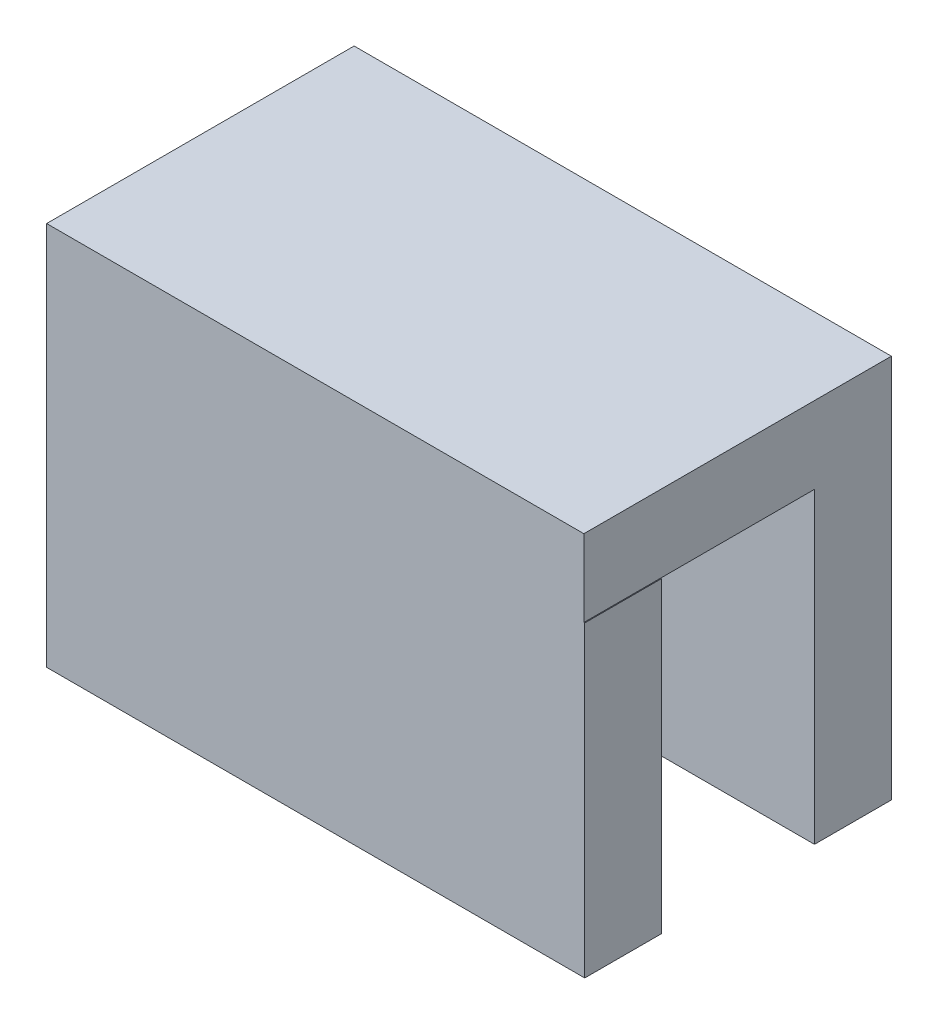
ISO-10303-21;
HEADER;
FILE_DESCRIPTION(('STEP AP214'),'2;1');
FILE_NAME('part.step','',(''),(''),'','','');
FILE_SCHEMA(('AUTOMOTIVE_DESIGN { 1 0 10303 214 1 1 1 1 }'));
ENDSEC;
DATA;
#1=APPLICATION_CONTEXT('core data for automotive mechanical design processes');
#2=APPLICATION_PROTOCOL_DEFINITION('international standard','automotive_design',2000,#1);
#3=PRODUCT_CONTEXT('',#1,'mechanical');
#4=PRODUCT('Part','Part','',(#3));
#5=PRODUCT_RELATED_PRODUCT_CATEGORY('part','',(#4));
#6=PRODUCT_DEFINITION_FORMATION('','',#4);
#7=PRODUCT_DEFINITION_CONTEXT('part definition',#1,'design');
#8=PRODUCT_DEFINITION('design','',#6,#7);
#9=PRODUCT_DEFINITION_SHAPE('','',#8);
#10=(LENGTH_UNIT() NAMED_UNIT(*) SI_UNIT(.MILLI.,.METRE.));
#11=(NAMED_UNIT(*) PLANE_ANGLE_UNIT() SI_UNIT($,.RADIAN.));
#12=(NAMED_UNIT(*) SI_UNIT($,.STERADIAN.) SOLID_ANGLE_UNIT());
#13=UNCERTAINTY_MEASURE_WITH_UNIT(LENGTH_MEASURE(1.E-05),#10,'distance_accuracy_value','');
#14=(GEOMETRIC_REPRESENTATION_CONTEXT(3) GLOBAL_UNCERTAINTY_ASSIGNED_CONTEXT((#13)) GLOBAL_UNIT_ASSIGNED_CONTEXT((#10,
#11,#12)) REPRESENTATION_CONTEXT('',''));
#15=CARTESIAN_POINT('',(0.,0.,0.));
#16=DIRECTION('',(0.,0.,1.));
#17=DIRECTION('',(1.,0.,0.));
#18=AXIS2_PLACEMENT_3D('',#15,#16,#17);
#19=CARTESIAN_POINT('',(0.,12.7,0.));
#20=DIRECTION('',(0.,-1.,0.));
#21=DIRECTION('',(0.,0.,-1.));
#22=AXIS2_PLACEMENT_3D('',#19,#20,#21);
#23=PLANE('',#22);
#24=DIRECTION('',(0.,0.,1.));
#25=VECTOR('',#24,1.);
#26=CARTESIAN_POINT('',(0.,12.7,3.175));
#27=LINE('',#26,#25);
#28=CARTESIAN_POINT('',(0.,12.7,-6.35));
#29=VERTEX_POINT('',#28);
#30=CARTESIAN_POINT('',(0.,12.7,0.));
#31=VERTEX_POINT('',#30);
#32=EDGE_CURVE('E135',#29,#31,#27,.T.);
#33=ORIENTED_EDGE('',*,*,#32,.F.);
#34=DIRECTION('',(-1.,0.,0.));
#35=VECTOR('',#34,1.);
#36=CARTESIAN_POINT('',(0.,12.7,-6.35));
#37=LINE('',#36,#35);
#38=CARTESIAN_POINT('',(19.0145562563066,12.7,-6.35));
#39=VERTEX_POINT('',#38);
#40=EDGE_CURVE('E143',#39,#29,#37,.T.);
#41=ORIENTED_EDGE('',*,*,#40,.F.);
#42=DIRECTION('',(0.,0.,-1.));
#43=VECTOR('',#42,1.);
#44=CARTESIAN_POINT('',(19.0145562563066,12.7,3.175));
#45=LINE('',#44,#43);
#46=CARTESIAN_POINT('',(19.0145562563066,12.7,0.));
#47=VERTEX_POINT('',#46);
#48=EDGE_CURVE('E187',#47,#39,#45,.T.);
#49=ORIENTED_EDGE('',*,*,#48,.F.);
#50=DIRECTION('',(-1.,0.,0.));
#51=VECTOR('',#50,1.);
#52=CARTESIAN_POINT('',(0.,12.7,0.));
#53=LINE('',#52,#51);
#54=EDGE_CURVE('E213',#47,#31,#53,.T.);
#55=ORIENTED_EDGE('',*,*,#54,.T.);
#56=EDGE_LOOP('',(#33,#41,#49,#55));
#57=FACE_BOUND('',#56,.T.);
#58=ADVANCED_FACE('F38',(#57),#23,.T.);
#59=CARTESIAN_POINT('',(0.,0.,0.));
#60=DIRECTION('',(-1.,0.,0.));
#61=DIRECTION('',(0.,0.,1.));
#62=AXIS2_PLACEMENT_3D('',#59,#60,#61);
#63=PLANE('',#62);
#64=CARTESIAN_POINT('',(0.,5.08,-3.175));
#65=DIRECTION('',(-1.,0.,0.));
#66=DIRECTION('',(0.,0.,1.));
#67=AXIS2_PLACEMENT_3D('',#64,#65,#66);
#68=CIRCLE('',#67,2.54);
#69=CARTESIAN_POINT('',(0.,5.08,-0.634999999999999));
#70=VERTEX_POINT('',#69);
#71=EDGE_CURVE('E158',#70,#70,#68,.T.);
#72=ORIENTED_EDGE('',*,*,#71,.T.);
#73=EDGE_LOOP('',(#72));
#74=FACE_BOUND('',#73,.T.);
#75=DIRECTION('',(0.,1.,0.));
#76=VECTOR('',#75,1.);
#77=CARTESIAN_POINT('',(0.,0.,-6.35));
#78=LINE('',#77,#76);
#79=CARTESIAN_POINT('',(0.,0.,-6.35));
#80=VERTEX_POINT('',#79);
#81=EDGE_CURVE('E54',#80,#29,#78,.T.);
#82=ORIENTED_EDGE('',*,*,#81,.T.);
#83=ORIENTED_EDGE('',*,*,#32,.T.);
#84=DIRECTION('',(0.,-1.,0.));
#85=VECTOR('',#84,1.);
#86=CARTESIAN_POINT('',(0.,0.,0.));
#87=LINE('',#86,#85);
#88=CARTESIAN_POINT('',(0.,0.,0.));
#89=VERTEX_POINT('',#88);
#90=EDGE_CURVE('E193',#31,#89,#87,.T.);
#91=ORIENTED_EDGE('',*,*,#90,.T.);
#92=DIRECTION('',(0.,0.,1.));
#93=VECTOR('',#92,1.);
#94=CARTESIAN_POINT('',(0.,0.,-9.525));
#95=LINE('',#94,#93);
#96=EDGE_CURVE('E162',#80,#89,#95,.T.);
#97=ORIENTED_EDGE('',*,*,#96,.F.);
#98=EDGE_LOOP('',(#82,#83,#91,#97));
#99=FACE_BOUND('',#98,.T.);
#100=ADVANCED_FACE('F243',(#74,#99),#63,.F.);
#101=CARTESIAN_POINT('',(0.,12.7,3.175));
#102=DIRECTION('',(0.,-1.,0.));
#103=DIRECTION('',(0.,0.,-1.));
#104=AXIS2_PLACEMENT_3D('',#101,#102,#103);
#105=PLANE('',#104);
#106=CARTESIAN_POINT('',(19.0145562563066,12.7,3.175));
#107=VERTEX_POINT('',#106);
#108=EDGE_CURVE('E62',#107,#47,#45,.T.);
#109=ORIENTED_EDGE('',*,*,#108,.F.);
#110=DIRECTION('',(-1.,0.,0.));
#111=VECTOR('',#110,1.);
#112=CARTESIAN_POINT('',(0.,12.7,3.175));
#113=LINE('',#112,#111);
#114=CARTESIAN_POINT('',(19.05,12.7,3.175));
#115=VERTEX_POINT('',#114);
#116=EDGE_CURVE('E201',#115,#107,#113,.T.);
#117=ORIENTED_EDGE('',*,*,#116,.F.);
#118=DIRECTION('',(0.,0.,-1.));
#119=VECTOR('',#118,1.);
#120=CARTESIAN_POINT('',(19.05,12.7,3.175));
#121=LINE('',#120,#119);
#122=CARTESIAN_POINT('',(19.05,12.7,0.));
#123=VERTEX_POINT('',#122);
#124=EDGE_CURVE('E47',#115,#123,#121,.T.);
#125=ORIENTED_EDGE('',*,*,#124,.T.);
#126=EDGE_CURVE('E198',#123,#47,#53,.T.);
#127=ORIENTED_EDGE('',*,*,#126,.T.);
#128=EDGE_LOOP('',(#109,#117,#125,#127));
#129=FACE_BOUND('',#128,.T.);
#130=ADVANCED_FACE('F219',(#129),#105,.F.);
#131=CARTESIAN_POINT('',(0.,0.,3.175));
#132=DIRECTION('',(0.,1.,0.));
#133=DIRECTION('',(0.,0.,1.));
#134=AXIS2_PLACEMENT_3D('',#131,#132,#133);
#135=PLANE('',#134);
#136=DIRECTION('',(1.,0.,0.));
#137=VECTOR('',#136,1.);
#138=CARTESIAN_POINT('',(0.,0.,0.));
#139=LINE('',#138,#137);
#140=CARTESIAN_POINT('',(19.05,0.,0.));
#141=VERTEX_POINT('',#140);
#142=EDGE_CURVE('E207',#89,#141,#139,.T.);
#143=ORIENTED_EDGE('',*,*,#142,.T.);
#144=DIRECTION('',(0.,0.,-1.));
#145=VECTOR('',#144,1.);
#146=CARTESIAN_POINT('',(19.05,0.,3.175));
#147=LINE('',#146,#145);
#148=CARTESIAN_POINT('',(19.05,0.,3.175));
#149=VERTEX_POINT('',#148);
#150=EDGE_CURVE('E11',#149,#141,#147,.T.);
#151=ORIENTED_EDGE('',*,*,#150,.F.);
#152=DIRECTION('',(1.,0.,0.));
#153=VECTOR('',#152,1.);
#154=CARTESIAN_POINT('',(0.,0.,3.175));
#155=LINE('',#154,#153);
#156=CARTESIAN_POINT('',(-3.175,0.,3.175));
#157=VERTEX_POINT('',#156);
#158=EDGE_CURVE('E194',#157,#149,#155,.T.);
#159=ORIENTED_EDGE('',*,*,#158,.F.);
#160=DIRECTION('',(0.,0.,1.));
#161=VECTOR('',#160,1.);
#162=CARTESIAN_POINT('',(-3.175,0.,-9.525));
#163=LINE('',#162,#161);
#164=CARTESIAN_POINT('',(-3.175,0.,-9.525));
#165=VERTEX_POINT('',#164);
#166=EDGE_CURVE('E132',#165,#157,#163,.T.);
#167=ORIENTED_EDGE('',*,*,#166,.F.);
#168=DIRECTION('',(1.,0.,0.));
#169=VECTOR('',#168,1.);
#170=CARTESIAN_POINT('',(-3.175,0.,-9.525));
#171=LINE('',#170,#169);
#172=CARTESIAN_POINT('',(19.0145562563066,0.,-9.525));
#173=VERTEX_POINT('',#172);
#174=EDGE_CURVE('E120',#165,#173,#171,.T.);
#175=ORIENTED_EDGE('',*,*,#174,.T.);
#176=DIRECTION('',(0.,0.,1.));
#177=VECTOR('',#176,1.);
#178=CARTESIAN_POINT('',(19.0145562563066,0.,-9.525));
#179=LINE('',#178,#177);
#180=CARTESIAN_POINT('',(19.0145562563066,0.,-6.35));
#181=VERTEX_POINT('',#180);
#182=EDGE_CURVE('E129',#173,#181,#179,.T.);
#183=ORIENTED_EDGE('',*,*,#182,.T.);
#184=DIRECTION('',(-1.,0.,0.));
#185=VECTOR('',#184,1.);
#186=CARTESIAN_POINT('',(0.,0.,-6.35));
#187=LINE('',#186,#185);
#188=EDGE_CURVE('E142',#181,#80,#187,.T.);
#189=ORIENTED_EDGE('',*,*,#188,.T.);
#190=ORIENTED_EDGE('',*,*,#96,.T.);
#191=EDGE_LOOP('',(#143,#151,#159,#167,#175,#183,#189,#190));
#192=FACE_BOUND('',#191,.T.);
#193=ADVANCED_FACE('F40',(#192),#135,.F.);
#194=CARTESIAN_POINT('',(19.05,0.,3.175));
#195=DIRECTION('',(-1.,0.,0.));
#196=DIRECTION('',(0.,0.,1.));
#197=AXIS2_PLACEMENT_3D('',#194,#195,#196);
#198=PLANE('',#197);
#199=DIRECTION('',(0.,1.,0.));
#200=VECTOR('',#199,1.);
#201=CARTESIAN_POINT('',(19.05,0.,0.));
#202=LINE('',#201,#200);
#203=EDGE_CURVE('E210',#141,#123,#202,.T.);
#204=ORIENTED_EDGE('',*,*,#203,.T.);
#205=ORIENTED_EDGE('',*,*,#124,.F.);
#206=DIRECTION('',(0.,1.,0.));
#207=VECTOR('',#206,1.);
#208=CARTESIAN_POINT('',(19.05,0.,3.175));
#209=LINE('',#208,#207);
#210=EDGE_CURVE('E197',#149,#115,#209,.T.);
#211=ORIENTED_EDGE('',*,*,#210,.F.);
#212=ORIENTED_EDGE('',*,*,#150,.T.);
#213=EDGE_LOOP('',(#204,#205,#211,#212));
#214=FACE_BOUND('',#213,.T.);
#215=ADVANCED_FACE('F240',(#214),#198,.F.);
#216=CARTESIAN_POINT('',(0.,0.,3.175));
#217=DIRECTION('',(0.,0.,-1.));
#218=DIRECTION('',(-1.,0.,0.));
#219=AXIS2_PLACEMENT_3D('',#216,#217,#218);
#220=PLANE('',#219);
#221=DIRECTION('',(1.,0.,0.));
#222=VECTOR('',#221,1.);
#223=CARTESIAN_POINT('',(0.,15.875,3.175));
#224=LINE('',#223,#222);
#225=CARTESIAN_POINT('',(-3.175,15.875,3.175));
#226=VERTEX_POINT('',#225);
#227=CARTESIAN_POINT('',(19.0145562563066,15.875,3.175));
#228=VERTEX_POINT('',#227);
#229=EDGE_CURVE('E177',#226,#228,#224,.T.);
#230=ORIENTED_EDGE('',*,*,#229,.F.);
#231=DIRECTION('',(0.,1.,0.));
#232=VECTOR('',#231,1.);
#233=CARTESIAN_POINT('',(-3.175,15.875,3.175));
#234=LINE('',#233,#232);
#235=EDGE_CURVE('E168',#157,#226,#234,.T.);
#236=ORIENTED_EDGE('',*,*,#235,.F.);
#237=ORIENTED_EDGE('',*,*,#158,.T.);
#238=ORIENTED_EDGE('',*,*,#210,.T.);
#239=ORIENTED_EDGE('',*,*,#116,.T.);
#240=DIRECTION('',(0.,-1.,0.));
#241=VECTOR('',#240,1.);
#242=CARTESIAN_POINT('',(19.0145562563066,15.875,3.175));
#243=LINE('',#242,#241);
#244=EDGE_CURVE('E126',#228,#107,#243,.T.);
#245=ORIENTED_EDGE('',*,*,#244,.F.);
#246=EDGE_LOOP('',(#230,#236,#237,#238,#239,#245));
#247=FACE_BOUND('',#246,.T.);
#248=ADVANCED_FACE('F237',(#247),#220,.F.);
#249=CARTESIAN_POINT('',(0.,0.,0.));
#250=DIRECTION('',(0.,0.,-1.));
#251=DIRECTION('',(-1.,0.,0.));
#252=AXIS2_PLACEMENT_3D('',#249,#250,#251);
#253=PLANE('',#252);
#254=ORIENTED_EDGE('',*,*,#90,.F.);
#255=ORIENTED_EDGE('',*,*,#54,.F.);
#256=ORIENTED_EDGE('',*,*,#126,.F.);
#257=ORIENTED_EDGE('',*,*,#203,.F.);
#258=ORIENTED_EDGE('',*,*,#142,.F.);
#259=EDGE_LOOP('',(#254,#255,#256,#257,#258));
#260=FACE_BOUND('',#259,.T.);
#261=ADVANCED_FACE('F226',(#260),#253,.T.);
#262=CARTESIAN_POINT('',(19.0145562563066,15.875,3.175));
#263=DIRECTION('',(-1.,0.,0.));
#264=DIRECTION('',(0.,0.,1.));
#265=AXIS2_PLACEMENT_3D('',#262,#263,#264);
#266=PLANE('',#265);
#267=ORIENTED_EDGE('',*,*,#108,.T.);
#268=ORIENTED_EDGE('',*,*,#48,.T.);
#269=DIRECTION('',(0.,1.,0.));
#270=VECTOR('',#269,1.);
#271=CARTESIAN_POINT('',(19.0145562563066,0.,-6.35));
#272=LINE('',#271,#270);
#273=EDGE_CURVE('E140',#181,#39,#272,.T.);
#274=ORIENTED_EDGE('',*,*,#273,.F.);
#275=ORIENTED_EDGE('',*,*,#182,.F.);
#276=DIRECTION('',(0.,-1.,0.));
#277=VECTOR('',#276,1.);
#278=CARTESIAN_POINT('',(19.0145562563066,15.875,-9.525));
#279=LINE('',#278,#277);
#280=CARTESIAN_POINT('',(19.0145562563066,15.875,-9.525));
#281=VERTEX_POINT('',#280);
#282=EDGE_CURVE('E116',#281,#173,#279,.T.);
#283=ORIENTED_EDGE('',*,*,#282,.F.);
#284=DIRECTION('',(0.,0.,-1.));
#285=VECTOR('',#284,1.);
#286=CARTESIAN_POINT('',(19.0145562563066,15.875,3.175));
#287=LINE('',#286,#285);
#288=EDGE_CURVE('E180',#228,#281,#287,.T.);
#289=ORIENTED_EDGE('',*,*,#288,.F.);
#290=ORIENTED_EDGE('',*,*,#244,.T.);
#291=EDGE_LOOP('',(#267,#268,#274,#275,#283,#289,#290));
#292=FACE_BOUND('',#291,.T.);
#293=ADVANCED_FACE('F138',(#292),#266,.F.);
#294=CARTESIAN_POINT('',(0.,15.875,-9.525));
#295=DIRECTION('',(0.,0.,1.));
#296=DIRECTION('',(1.,0.,0.));
#297=AXIS2_PLACEMENT_3D('',#294,#295,#296);
#298=PLANE('',#297);
#299=ORIENTED_EDGE('',*,*,#282,.T.);
#300=ORIENTED_EDGE('',*,*,#174,.F.);
#301=DIRECTION('',(0.,-1.,0.));
#302=VECTOR('',#301,1.);
#303=CARTESIAN_POINT('',(-3.175,15.875,-9.525));
#304=LINE('',#303,#302);
#305=CARTESIAN_POINT('',(-3.175,15.875,-9.525));
#306=VERTEX_POINT('',#305);
#307=EDGE_CURVE('E163',#306,#165,#304,.T.);
#308=ORIENTED_EDGE('',*,*,#307,.F.);
#309=DIRECTION('',(-1.,0.,0.));
#310=VECTOR('',#309,1.);
#311=CARTESIAN_POINT('',(0.,15.875,-9.525));
#312=LINE('',#311,#310);
#313=EDGE_CURVE('E121',#281,#306,#312,.T.);
#314=ORIENTED_EDGE('',*,*,#313,.F.);
#315=EDGE_LOOP('',(#299,#300,#308,#314));
#316=FACE_BOUND('',#315,.T.);
#317=ADVANCED_FACE('F118',(#316),#298,.F.);
#318=CARTESIAN_POINT('',(0.,15.875,0.));
#319=DIRECTION('',(0.,-1.,0.));
#320=DIRECTION('',(0.,0.,-1.));
#321=AXIS2_PLACEMENT_3D('',#318,#319,#320);
#322=PLANE('',#321);
#323=ORIENTED_EDGE('',*,*,#313,.T.);
#324=DIRECTION('',(0.,0.,-1.));
#325=VECTOR('',#324,1.);
#326=CARTESIAN_POINT('',(-3.175,15.875,-9.525));
#327=LINE('',#326,#325);
#328=EDGE_CURVE('E136',#226,#306,#327,.T.);
#329=ORIENTED_EDGE('',*,*,#328,.F.);
#330=ORIENTED_EDGE('',*,*,#229,.T.);
#331=ORIENTED_EDGE('',*,*,#288,.T.);
#332=EDGE_LOOP('',(#323,#329,#330,#331));
#333=FACE_BOUND('',#332,.T.);
#334=ADVANCED_FACE('F257',(#333),#322,.F.);
#335=CARTESIAN_POINT('',(-3.175,0.,0.));
#336=DIRECTION('',(-1.,0.,0.));
#337=DIRECTION('',(0.,0.,1.));
#338=AXIS2_PLACEMENT_3D('',#335,#336,#337);
#339=PLANE('',#338);
#340=CARTESIAN_POINT('',(-3.175,5.08,-3.175));
#341=DIRECTION('',(-1.,0.,0.));
#342=DIRECTION('',(0.,0.,1.));
#343=AXIS2_PLACEMENT_3D('',#340,#341,#342);
#344=CIRCLE('',#343,2.54);
#345=CARTESIAN_POINT('',(-3.175,5.08,-0.634999999999999));
#346=VERTEX_POINT('',#345);
#347=EDGE_CURVE('E154',#346,#346,#344,.T.);
#348=ORIENTED_EDGE('',*,*,#347,.F.);
#349=EDGE_LOOP('',(#348));
#350=FACE_BOUND('',#349,.T.);
#351=ORIENTED_EDGE('',*,*,#307,.T.);
#352=ORIENTED_EDGE('',*,*,#166,.T.);
#353=ORIENTED_EDGE('',*,*,#235,.T.);
#354=ORIENTED_EDGE('',*,*,#328,.T.);
#355=EDGE_LOOP('',(#351,#352,#353,#354));
#356=FACE_BOUND('',#355,.T.);
#357=ADVANCED_FACE('F255',(#350,#356),#339,.T.);
#358=CARTESIAN_POINT('',(19.05,5.08,-3.175));
#359=DIRECTION('',(-1.,0.,0.));
#360=DIRECTION('',(0.,0.,1.));
#361=AXIS2_PLACEMENT_3D('',#358,#359,#360);
#362=CYLINDRICAL_SURFACE('',#361,2.54);
#363=ORIENTED_EDGE('',*,*,#347,.T.);
#364=EDGE_LOOP('',(#363));
#365=FACE_BOUND('',#364,.T.);
#366=ORIENTED_EDGE('',*,*,#71,.F.);
#367=EDGE_LOOP('',(#366));
#368=FACE_BOUND('',#367,.T.);
#369=ADVANCED_FACE('F313',(#365,#368),#362,.F.);
#370=CARTESIAN_POINT('',(0.,0.,-6.35));
#371=DIRECTION('',(0.,0.,-1.));
#372=DIRECTION('',(-1.,0.,0.));
#373=AXIS2_PLACEMENT_3D('',#370,#371,#372);
#374=PLANE('',#373);
#375=ORIENTED_EDGE('',*,*,#40,.T.);
#376=ORIENTED_EDGE('',*,*,#81,.F.);
#377=ORIENTED_EDGE('',*,*,#188,.F.);
#378=ORIENTED_EDGE('',*,*,#273,.T.);
#379=EDGE_LOOP('',(#375,#376,#377,#378));
#380=FACE_BOUND('',#379,.T.);
#381=ADVANCED_FACE('F322',(#380),#374,.F.);
#382=CLOSED_SHELL('',(#58,#100,#130,#193,#215,#248,#261,#293,#317,#334,#357,#369,#381));
#383=MANIFOLD_SOLID_BREP('B2',#382);
#384=ADVANCED_BREP_SHAPE_REPRESENTATION('',(#18,#383),#14);
#385=SHAPE_DEFINITION_REPRESENTATION(#9,#384);
ENDSEC;
END-ISO-10303-21;
